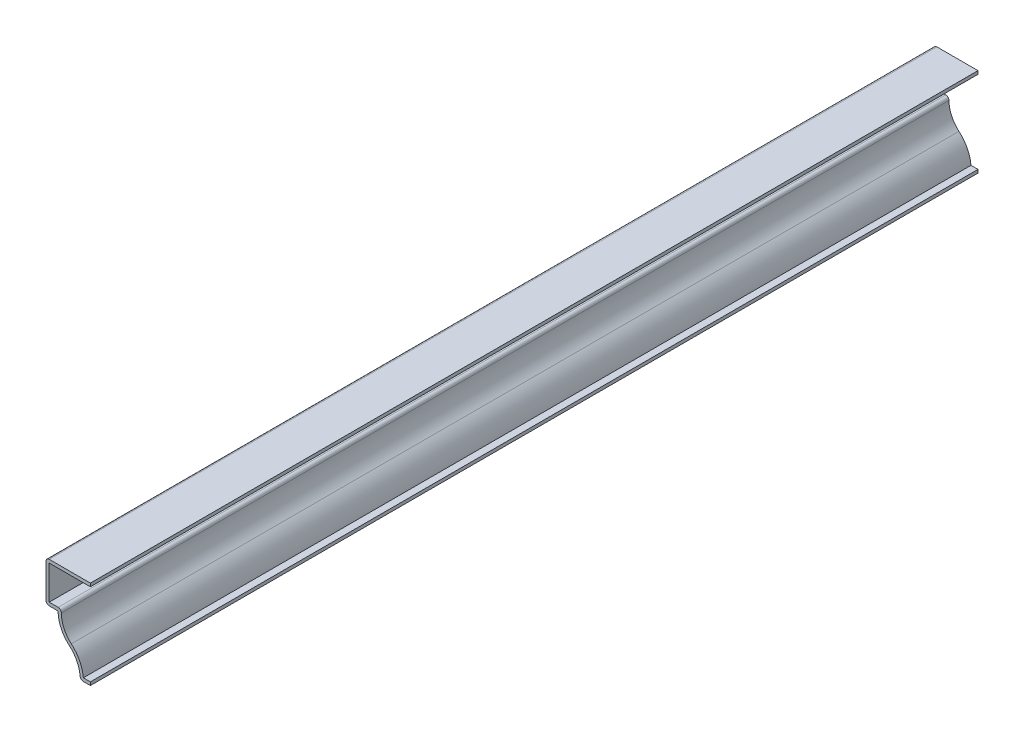
ISO-10303-21;
HEADER;
FILE_DESCRIPTION(('STEP AP214'),'2;1');
FILE_NAME('part.step','',(''),(''),'','','');
FILE_SCHEMA(('AUTOMOTIVE_DESIGN { 1 0 10303 214 1 1 1 1 }'));
ENDSEC;
DATA;
#1=APPLICATION_CONTEXT('core data for automotive mechanical design processes');
#2=APPLICATION_PROTOCOL_DEFINITION('international standard','automotive_design',2000,#1);
#3=PRODUCT_CONTEXT('',#1,'mechanical');
#4=PRODUCT('Part','Part','',(#3));
#5=PRODUCT_RELATED_PRODUCT_CATEGORY('part','',(#4));
#6=PRODUCT_DEFINITION_FORMATION('','',#4);
#7=PRODUCT_DEFINITION_CONTEXT('part definition',#1,'design');
#8=PRODUCT_DEFINITION('design','',#6,#7);
#9=PRODUCT_DEFINITION_SHAPE('','',#8);
#10=(LENGTH_UNIT() NAMED_UNIT(*) SI_UNIT(.MILLI.,.METRE.));
#11=(NAMED_UNIT(*) PLANE_ANGLE_UNIT() SI_UNIT($,.RADIAN.));
#12=(NAMED_UNIT(*) SI_UNIT($,.STERADIAN.) SOLID_ANGLE_UNIT());
#13=UNCERTAINTY_MEASURE_WITH_UNIT(LENGTH_MEASURE(1.E-05),#10,'distance_accuracy_value','');
#14=(GEOMETRIC_REPRESENTATION_CONTEXT(3) GLOBAL_UNCERTAINTY_ASSIGNED_CONTEXT((#13)) GLOBAL_UNIT_ASSIGNED_CONTEXT((#10,
#11,#12)) REPRESENTATION_CONTEXT('',''));
#15=CARTESIAN_POINT('',(0.,0.,0.));
#16=DIRECTION('',(0.,0.,1.));
#17=DIRECTION('',(1.,0.,0.));
#18=AXIS2_PLACEMENT_3D('',#15,#16,#17);
#19=CARTESIAN_POINT('',(0.,0.,-349.25));
#20=DIRECTION('',(0.,-1.,0.));
#21=DIRECTION('',(0.,0.,-1.));
#22=AXIS2_PLACEMENT_3D('',#19,#20,#21);
#23=PLANE('',#22);
#24=DIRECTION('',(1.,0.,0.));
#25=VECTOR('',#24,1.);
#26=CARTESIAN_POINT('',(0.,0.,0.));
#27=LINE('',#26,#25);
#28=CARTESIAN_POINT('',(-2.75712692758629,0.,0.));
#29=VERTEX_POINT('',#28);
#30=CARTESIAN_POINT('',(0.,0.,0.));
#31=VERTEX_POINT('',#30);
#32=EDGE_CURVE('E294',#29,#31,#27,.T.);
#33=ORIENTED_EDGE('',*,*,#32,.F.);
#34=DIRECTION('',(0.,0.,1.));
#35=VECTOR('',#34,1.);
#36=CARTESIAN_POINT('',(-2.75712692758629,0.,-349.25));
#37=LINE('',#36,#35);
#38=CARTESIAN_POINT('',(-2.75712692758629,0.,-349.25));
#39=VERTEX_POINT('',#38);
#40=EDGE_CURVE('E169',#29,#39,#37,.F.);
#41=ORIENTED_EDGE('',*,*,#40,.T.);
#42=DIRECTION('',(1.,0.,0.));
#43=VECTOR('',#42,1.);
#44=CARTESIAN_POINT('',(0.,0.,-349.25));
#45=LINE('',#44,#43);
#46=CARTESIAN_POINT('',(0.,0.,-349.25));
#47=VERTEX_POINT('',#46);
#48=EDGE_CURVE('E162',#39,#47,#45,.T.);
#49=ORIENTED_EDGE('',*,*,#48,.T.);
#50=DIRECTION('',(0.,0.,1.));
#51=VECTOR('',#50,1.);
#52=CARTESIAN_POINT('',(0.,0.,-349.25));
#53=LINE('',#52,#51);
#54=EDGE_CURVE('E166',#47,#31,#53,.T.);
#55=ORIENTED_EDGE('',*,*,#54,.T.);
#56=EDGE_LOOP('',(#33,#41,#49,#55));
#57=FACE_BOUND('',#56,.T.);
#58=ADVANCED_FACE('F35',(#57),#23,.T.);
#59=CARTESIAN_POINT('',(-16.5424715909091,0.,-349.25));
#60=DIRECTION('',(0.,0.,1.));
#61=DIRECTION('',(1.,0.,0.));
#62=AXIS2_PLACEMENT_3D('',#59,#60,#61);
#63=CYLINDRICAL_SURFACE('',#62,12.5737215909091);
#64=CARTESIAN_POINT('',(-16.5424715909091,0.,-349.25));
#65=DIRECTION('',(0.,0.,-1.));
#66=DIRECTION('',(-1.,0.,0.));
#67=AXIS2_PLACEMENT_3D('',#64,#65,#66);
#68=CIRCLE('',#67,12.5737215909091);
#69=CARTESIAN_POINT('',(-8.334375,9.525,-349.25));
#70=VERTEX_POINT('',#69);
#71=CARTESIAN_POINT('',(-4.02177152531619,1.15349231170185,-349.25));
#72=VERTEX_POINT('',#71);
#73=EDGE_CURVE('E186',#70,#72,#68,.T.);
#74=ORIENTED_EDGE('',*,*,#73,.T.);
#75=DIRECTION('',(0.,0.,1.));
#76=VECTOR('',#75,1.);
#77=CARTESIAN_POINT('',(-4.02177152531619,1.15349231170185,-349.25));
#78=LINE('',#77,#76);
#79=CARTESIAN_POINT('',(-4.02177152531619,1.15349231170185,0.));
#80=VERTEX_POINT('',#79);
#81=EDGE_CURVE('E195',#72,#80,#78,.T.);
#82=ORIENTED_EDGE('',*,*,#81,.T.);
#83=CARTESIAN_POINT('',(-16.5424715909091,0.,0.));
#84=DIRECTION('',(0.,0.,-1.));
#85=DIRECTION('',(-1.,0.,0.));
#86=AXIS2_PLACEMENT_3D('',#83,#84,#85);
#87=CIRCLE('',#86,12.5737215909091);
#88=CARTESIAN_POINT('',(-8.334375,9.525,0.));
#89=VERTEX_POINT('',#88);
#90=EDGE_CURVE('E172',#89,#80,#87,.T.);
#91=ORIENTED_EDGE('',*,*,#90,.F.);
#92=DIRECTION('',(0.,0.,1.));
#93=VECTOR('',#92,1.);
#94=CARTESIAN_POINT('',(-8.334375,9.525,-349.25));
#95=LINE('',#94,#93);
#96=EDGE_CURVE('E199',#70,#89,#95,.T.);
#97=ORIENTED_EDGE('',*,*,#96,.F.);
#98=EDGE_LOOP('',(#74,#82,#91,#97));
#99=FACE_BOUND('',#98,.T.);
#100=ADVANCED_FACE('F343',(#99),#63,.F.);
#101=CARTESIAN_POINT('',(-0.126278409090908,19.05,-349.25));
#102=DIRECTION('',(0.,0.,1.));
#103=DIRECTION('',(1.,0.,0.));
#104=AXIS2_PLACEMENT_3D('',#101,#102,#103);
#105=CYLINDRICAL_SURFACE('',#104,12.5737215909091);
#106=CARTESIAN_POINT('',(-0.126278409090908,19.05,0.));
#107=DIRECTION('',(0.,0.,1.));
#108=DIRECTION('',(1.,0.,0.));
#109=AXIS2_PLACEMENT_3D('',#106,#107,#108);
#110=CIRCLE('',#109,12.5737215909091);
#111=CARTESIAN_POINT('',(-12.7,19.05,0.));
#112=VERTEX_POINT('',#111);
#113=EDGE_CURVE('E255',#112,#89,#110,.T.);
#114=ORIENTED_EDGE('',*,*,#113,.F.);
#115=DIRECTION('',(0.,0.,1.));
#116=VECTOR('',#115,1.);
#117=CARTESIAN_POINT('',(-12.7,19.05,-349.25));
#118=LINE('',#117,#116);
#119=CARTESIAN_POINT('',(-12.7,19.05,-349.25));
#120=VERTEX_POINT('',#119);
#121=EDGE_CURVE('E265',#120,#112,#118,.T.);
#122=ORIENTED_EDGE('',*,*,#121,.F.);
#123=CARTESIAN_POINT('',(-0.126278409090908,19.05,-349.25));
#124=DIRECTION('',(0.,0.,1.));
#125=DIRECTION('',(1.,0.,0.));
#126=AXIS2_PLACEMENT_3D('',#123,#124,#125);
#127=CIRCLE('',#126,12.5737215909091);
#128=EDGE_CURVE('E191',#120,#70,#127,.T.);
#129=ORIENTED_EDGE('',*,*,#128,.T.);
#130=ORIENTED_EDGE('',*,*,#96,.T.);
#131=EDGE_LOOP('',(#114,#122,#129,#130));
#132=FACE_BOUND('',#131,.T.);
#133=ADVANCED_FACE('F347',(#132),#105,.T.);
#134=CARTESIAN_POINT('',(-17.4625,19.05,-349.25));
#135=DIRECTION('',(0.,-1.,0.));
#136=DIRECTION('',(1.,0.,0.));
#137=AXIS2_PLACEMENT_3D('',#134,#135,#136);
#138=PLANE('',#137);
#139=DIRECTION('',(1.,0.,0.));
#140=VECTOR('',#139,1.);
#141=CARTESIAN_POINT('',(-17.4625,19.05,0.));
#142=LINE('',#141,#140);
#143=CARTESIAN_POINT('',(-16.1925,19.05,0.));
#144=VERTEX_POINT('',#143);
#145=EDGE_CURVE('E231',#144,#112,#142,.T.);
#146=ORIENTED_EDGE('',*,*,#145,.F.);
#147=DIRECTION('',(0.,0.,1.));
#148=VECTOR('',#147,1.);
#149=CARTESIAN_POINT('',(-16.1925,19.05,-349.25));
#150=LINE('',#149,#148);
#151=CARTESIAN_POINT('',(-16.1925,19.05,-349.25));
#152=VERTEX_POINT('',#151);
#153=EDGE_CURVE('E43',#144,#152,#150,.F.);
#154=ORIENTED_EDGE('',*,*,#153,.T.);
#155=DIRECTION('',(1.,0.,0.));
#156=VECTOR('',#155,1.);
#157=CARTESIAN_POINT('',(-17.4625,19.05,-349.25));
#158=LINE('',#157,#156);
#159=EDGE_CURVE('E229',#152,#120,#158,.T.);
#160=ORIENTED_EDGE('',*,*,#159,.T.);
#161=ORIENTED_EDGE('',*,*,#121,.T.);
#162=EDGE_LOOP('',(#146,#154,#160,#161));
#163=FACE_BOUND('',#162,.T.);
#164=ADVANCED_FACE('F227',(#163),#138,.T.);
#165=CARTESIAN_POINT('',(-17.4625,34.925,-349.25));
#166=DIRECTION('',(-1.,0.,0.));
#167=DIRECTION('',(0.,-1.,0.));
#168=AXIS2_PLACEMENT_3D('',#165,#166,#167);
#169=PLANE('',#168);
#170=DIRECTION('',(0.,-1.,0.));
#171=VECTOR('',#170,1.);
#172=CARTESIAN_POINT('',(-17.4625,34.925,-349.25));
#173=LINE('',#172,#171);
#174=CARTESIAN_POINT('',(-17.4625,33.655,-349.25));
#175=VERTEX_POINT('',#174);
#176=CARTESIAN_POINT('',(-17.4625,20.32,-349.25));
#177=VERTEX_POINT('',#176);
#178=EDGE_CURVE('E239',#175,#177,#173,.T.);
#179=ORIENTED_EDGE('',*,*,#178,.T.);
#180=DIRECTION('',(0.,0.,1.));
#181=VECTOR('',#180,1.);
#182=CARTESIAN_POINT('',(-17.4625,20.32,-349.25));
#183=LINE('',#182,#181);
#184=CARTESIAN_POINT('',(-17.4625,20.32,0.));
#185=VERTEX_POINT('',#184);
#186=EDGE_CURVE('E221',#177,#185,#183,.T.);
#187=ORIENTED_EDGE('',*,*,#186,.T.);
#188=DIRECTION('',(0.,-1.,0.));
#189=VECTOR('',#188,1.);
#190=CARTESIAN_POINT('',(-17.4625,34.925,0.));
#191=LINE('',#190,#189);
#192=CARTESIAN_POINT('',(-17.4625,33.655,0.));
#193=VERTEX_POINT('',#192);
#194=EDGE_CURVE('E247',#193,#185,#191,.T.);
#195=ORIENTED_EDGE('',*,*,#194,.F.);
#196=DIRECTION('',(0.,0.,1.));
#197=VECTOR('',#196,1.);
#198=CARTESIAN_POINT('',(-17.4625,33.655,-349.25));
#199=LINE('',#198,#197);
#200=EDGE_CURVE('E219',#193,#175,#199,.F.);
#201=ORIENTED_EDGE('',*,*,#200,.T.);
#202=EDGE_LOOP('',(#179,#187,#195,#201));
#203=FACE_BOUND('',#202,.T.);
#204=ADVANCED_FACE('F246',(#203),#169,.T.);
#205=CARTESIAN_POINT('',(0.,34.925,-349.25));
#206=DIRECTION('',(0.,1.,0.));
#207=DIRECTION('',(0.,0.,1.));
#208=AXIS2_PLACEMENT_3D('',#205,#206,#207);
#209=PLANE('',#208);
#210=DIRECTION('',(-1.,0.,0.));
#211=VECTOR('',#210,1.);
#212=CARTESIAN_POINT('',(0.,34.925,-349.25));
#213=LINE('',#212,#211);
#214=CARTESIAN_POINT('',(0.,34.925,-349.25));
#215=VERTEX_POINT('',#214);
#216=CARTESIAN_POINT('',(-16.1925,34.925,-349.25));
#217=VERTEX_POINT('',#216);
#218=EDGE_CURVE('E335',#215,#217,#213,.T.);
#219=ORIENTED_EDGE('',*,*,#218,.T.);
#220=DIRECTION('',(0.,0.,1.));
#221=VECTOR('',#220,1.);
#222=CARTESIAN_POINT('',(-16.1925,34.925,-349.25));
#223=LINE('',#222,#221);
#224=CARTESIAN_POINT('',(-16.1925,34.925,0.));
#225=VERTEX_POINT('',#224);
#226=EDGE_CURVE('E11',#217,#225,#223,.T.);
#227=ORIENTED_EDGE('',*,*,#226,.T.);
#228=DIRECTION('',(-1.,0.,0.));
#229=VECTOR('',#228,1.);
#230=CARTESIAN_POINT('',(0.,34.925,0.));
#231=LINE('',#230,#229);
#232=CARTESIAN_POINT('',(0.,34.925,0.));
#233=VERTEX_POINT('',#232);
#234=EDGE_CURVE('E253',#233,#225,#231,.T.);
#235=ORIENTED_EDGE('',*,*,#234,.F.);
#236=DIRECTION('',(0.,0.,1.));
#237=VECTOR('',#236,1.);
#238=CARTESIAN_POINT('',(0.,34.925,-349.25));
#239=LINE('',#238,#237);
#240=EDGE_CURVE('E267',#215,#233,#239,.T.);
#241=ORIENTED_EDGE('',*,*,#240,.F.);
#242=EDGE_LOOP('',(#219,#227,#235,#241));
#243=FACE_BOUND('',#242,.T.);
#244=ADVANCED_FACE('F379',(#243),#209,.T.);
#245=CARTESIAN_POINT('',(0.,34.925,-349.25));
#246=DIRECTION('',(-1.,0.,0.));
#247=DIRECTION('',(0.,0.,1.));
#248=AXIS2_PLACEMENT_3D('',#245,#246,#247);
#249=PLANE('',#248);
#250=DIRECTION('',(0.,-1.,0.));
#251=VECTOR('',#250,1.);
#252=CARTESIAN_POINT('',(0.,34.925,0.));
#253=LINE('',#252,#251);
#254=CARTESIAN_POINT('',(0.,33.655,0.));
#255=VERTEX_POINT('',#254);
#256=EDGE_CURVE('E257',#233,#255,#253,.T.);
#257=ORIENTED_EDGE('',*,*,#256,.T.);
#258=DIRECTION('',(0.,0.,1.));
#259=VECTOR('',#258,1.);
#260=CARTESIAN_POINT('',(0.,33.655,-349.25));
#261=LINE('',#260,#259);
#262=CARTESIAN_POINT('',(0.,33.655,-349.25));
#263=VERTEX_POINT('',#262);
#264=EDGE_CURVE('E269',#263,#255,#261,.T.);
#265=ORIENTED_EDGE('',*,*,#264,.F.);
#266=DIRECTION('',(0.,-1.,0.));
#267=VECTOR('',#266,1.);
#268=CARTESIAN_POINT('',(0.,34.925,-349.25));
#269=LINE('',#268,#267);
#270=EDGE_CURVE('E333',#215,#263,#269,.T.);
#271=ORIENTED_EDGE('',*,*,#270,.F.);
#272=ORIENTED_EDGE('',*,*,#240,.T.);
#273=EDGE_LOOP('',(#257,#265,#271,#272));
#274=FACE_BOUND('',#273,.T.);
#275=ADVANCED_FACE('F307',(#274),#249,.F.);
#276=CARTESIAN_POINT('',(0.,33.655,-349.25));
#277=DIRECTION('',(0.,1.,0.));
#278=DIRECTION('',(0.,0.,1.));
#279=AXIS2_PLACEMENT_3D('',#276,#277,#278);
#280=PLANE('',#279);
#281=DIRECTION('',(1.,0.,0.));
#282=VECTOR('',#281,1.);
#283=CARTESIAN_POINT('',(0.,33.655,0.));
#284=LINE('',#283,#282);
#285=CARTESIAN_POINT('',(-16.1925,33.655,0.));
#286=VERTEX_POINT('',#285);
#287=EDGE_CURVE('E303',#255,#286,#284,.F.);
#288=ORIENTED_EDGE('',*,*,#287,.T.);
#289=DIRECTION('',(0.,0.,1.));
#290=VECTOR('',#289,1.);
#291=CARTESIAN_POINT('',(-16.1925,33.655,-349.25));
#292=LINE('',#291,#290);
#293=CARTESIAN_POINT('',(-16.1925,33.655,-349.25));
#294=VERTEX_POINT('',#293);
#295=EDGE_CURVE('E272',#294,#286,#292,.T.);
#296=ORIENTED_EDGE('',*,*,#295,.F.);
#297=DIRECTION('',(1.,0.,0.));
#298=VECTOR('',#297,1.);
#299=CARTESIAN_POINT('',(0.,33.655,-349.25));
#300=LINE('',#299,#298);
#301=EDGE_CURVE('E315',#263,#294,#300,.F.);
#302=ORIENTED_EDGE('',*,*,#301,.F.);
#303=ORIENTED_EDGE('',*,*,#264,.T.);
#304=EDGE_LOOP('',(#288,#296,#302,#303));
#305=FACE_BOUND('',#304,.T.);
#306=ADVANCED_FACE('F313',(#305),#280,.F.);
#307=CARTESIAN_POINT('',(-16.1925,34.925,-349.25));
#308=DIRECTION('',(-1.,0.,0.));
#309=DIRECTION('',(0.,-1.,0.));
#310=AXIS2_PLACEMENT_3D('',#307,#308,#309);
#311=PLANE('',#310);
#312=DIRECTION('',(0.,-1.,0.));
#313=VECTOR('',#312,1.);
#314=CARTESIAN_POINT('',(-16.1925,34.925,0.));
#315=LINE('',#314,#313);
#316=CARTESIAN_POINT('',(-16.1925,20.32,0.));
#317=VERTEX_POINT('',#316);
#318=EDGE_CURVE('E301',#286,#317,#315,.T.);
#319=ORIENTED_EDGE('',*,*,#318,.T.);
#320=DIRECTION('',(0.,0.,1.));
#321=VECTOR('',#320,1.);
#322=CARTESIAN_POINT('',(-16.1925,20.32,-349.25));
#323=LINE('',#322,#321);
#324=CARTESIAN_POINT('',(-16.1925,20.32,-349.25));
#325=VERTEX_POINT('',#324);
#326=EDGE_CURVE('E275',#325,#317,#323,.T.);
#327=ORIENTED_EDGE('',*,*,#326,.F.);
#328=DIRECTION('',(0.,-1.,0.));
#329=VECTOR('',#328,1.);
#330=CARTESIAN_POINT('',(-16.1925,34.925,-349.25));
#331=LINE('',#330,#329);
#332=EDGE_CURVE('E324',#294,#325,#331,.T.);
#333=ORIENTED_EDGE('',*,*,#332,.F.);
#334=ORIENTED_EDGE('',*,*,#295,.T.);
#335=EDGE_LOOP('',(#319,#327,#333,#334));
#336=FACE_BOUND('',#335,.T.);
#337=ADVANCED_FACE('F320',(#336),#311,.F.);
#338=CARTESIAN_POINT('',(-17.4625,20.32,-349.25));
#339=DIRECTION('',(0.,-1.,0.));
#340=DIRECTION('',(1.,0.,0.));
#341=AXIS2_PLACEMENT_3D('',#338,#339,#340);
#342=PLANE('',#341);
#343=DIRECTION('',(1.,0.,0.));
#344=VECTOR('',#343,1.);
#345=CARTESIAN_POINT('',(-17.4625,20.32,0.));
#346=LINE('',#345,#344);
#347=CARTESIAN_POINT('',(-12.7,20.32,0.));
#348=VERTEX_POINT('',#347);
#349=EDGE_CURVE('E299',#317,#348,#346,.T.);
#350=ORIENTED_EDGE('',*,*,#349,.T.);
#351=DIRECTION('',(0.,0.,1.));
#352=VECTOR('',#351,1.);
#353=CARTESIAN_POINT('',(-12.7,20.32,-349.25));
#354=LINE('',#353,#352);
#355=CARTESIAN_POINT('',(-12.7,20.32,-349.25));
#356=VERTEX_POINT('',#355);
#357=EDGE_CURVE('E58',#348,#356,#354,.F.);
#358=ORIENTED_EDGE('',*,*,#357,.T.);
#359=DIRECTION('',(1.,0.,0.));
#360=VECTOR('',#359,1.);
#361=CARTESIAN_POINT('',(-17.4625,20.32,-349.25));
#362=LINE('',#361,#360);
#363=EDGE_CURVE('E323',#325,#356,#362,.T.);
#364=ORIENTED_EDGE('',*,*,#363,.F.);
#365=ORIENTED_EDGE('',*,*,#326,.T.);
#366=EDGE_LOOP('',(#350,#358,#364,#365));
#367=FACE_BOUND('',#366,.T.);
#368=ADVANCED_FACE('F322',(#367),#342,.F.);
#369=CARTESIAN_POINT('',(-0.126278409090908,19.05,-349.25));
#370=DIRECTION('',(0.,0.,1.));
#371=DIRECTION('',(1.,0.,0.));
#372=AXIS2_PLACEMENT_3D('',#369,#370,#371);
#373=CYLINDRICAL_SURFACE('',#372,11.3037215909091);
#374=CARTESIAN_POINT('',(-0.126278409090908,19.05,-349.25));
#375=DIRECTION('',(0.,0.,1.));
#376=DIRECTION('',(1.,0.,0.));
#377=AXIS2_PLACEMENT_3D('',#374,#375,#376);
#378=CIRCLE('',#377,11.3037215909091);
#379=CARTESIAN_POINT('',(-11.43,19.05,-349.25));
#380=VERTEX_POINT('',#379);
#381=CARTESIAN_POINT('',(-7.50532191535151,10.4870659971306,-349.25));
#382=VERTEX_POINT('',#381);
#383=EDGE_CURVE('E325',#380,#382,#378,.T.);
#384=ORIENTED_EDGE('',*,*,#383,.F.);
#385=DIRECTION('',(0.,0.,1.));
#386=VECTOR('',#385,1.);
#387=CARTESIAN_POINT('',(-11.43,19.05,-349.25));
#388=LINE('',#387,#386);
#389=CARTESIAN_POINT('',(-11.43,19.05,0.));
#390=VERTEX_POINT('',#389);
#391=EDGE_CURVE('E215',#380,#390,#388,.T.);
#392=ORIENTED_EDGE('',*,*,#391,.T.);
#393=CARTESIAN_POINT('',(-0.126278409090908,19.05,0.));
#394=DIRECTION('',(0.,0.,1.));
#395=DIRECTION('',(1.,0.,0.));
#396=AXIS2_PLACEMENT_3D('',#393,#394,#395);
#397=CIRCLE('',#396,11.3037215909091);
#398=CARTESIAN_POINT('',(-7.50532191535151,10.4870659971306,0.));
#399=VERTEX_POINT('',#398);
#400=EDGE_CURVE('E292',#390,#399,#397,.T.);
#401=ORIENTED_EDGE('',*,*,#400,.T.);
#402=DIRECTION('',(0.,0.,1.));
#403=VECTOR('',#402,1.);
#404=CARTESIAN_POINT('',(-7.50532191535151,10.4870659971306,-349.25));
#405=LINE('',#404,#403);
#406=EDGE_CURVE('E278',#382,#399,#405,.T.);
#407=ORIENTED_EDGE('',*,*,#406,.F.);
#408=EDGE_LOOP('',(#384,#392,#401,#407));
#409=FACE_BOUND('',#408,.T.);
#410=ADVANCED_FACE('F395',(#409),#373,.F.);
#411=CARTESIAN_POINT('',(-16.5424715909091,0.,-349.25));
#412=DIRECTION('',(0.,0.,1.));
#413=DIRECTION('',(1.,0.,0.));
#414=AXIS2_PLACEMENT_3D('',#411,#412,#413);
#415=CYLINDRICAL_SURFACE('',#414,13.8437215909091);
#416=CARTESIAN_POINT('',(-16.5424715909091,0.,0.));
#417=DIRECTION('',(0.,0.,1.));
#418=DIRECTION('',(1.,0.,0.));
#419=AXIS2_PLACEMENT_3D('',#416,#417,#418);
#420=CIRCLE('',#419,13.8437215909091);
#421=CARTESIAN_POINT('',(-2.75712692758629,1.27,0.));
#422=VERTEX_POINT('',#421);
#423=EDGE_CURVE('E290',#399,#422,#420,.F.);
#424=ORIENTED_EDGE('',*,*,#423,.T.);
#425=DIRECTION('',(0.,0.,1.));
#426=VECTOR('',#425,1.);
#427=CARTESIAN_POINT('',(-2.75712692758629,1.27,-349.25));
#428=LINE('',#427,#426);
#429=CARTESIAN_POINT('',(-2.75712692758629,1.27,-349.25));
#430=VERTEX_POINT('',#429);
#431=EDGE_CURVE('E188',#430,#422,#428,.T.);
#432=ORIENTED_EDGE('',*,*,#431,.F.);
#433=CARTESIAN_POINT('',(-16.5424715909091,0.,-349.25));
#434=DIRECTION('',(0.,0.,1.));
#435=DIRECTION('',(1.,0.,0.));
#436=AXIS2_PLACEMENT_3D('',#433,#434,#435);
#437=CIRCLE('',#436,13.8437215909091);
#438=EDGE_CURVE('E328',#382,#430,#437,.F.);
#439=ORIENTED_EDGE('',*,*,#438,.F.);
#440=ORIENTED_EDGE('',*,*,#406,.T.);
#441=EDGE_LOOP('',(#424,#432,#439,#440));
#442=FACE_BOUND('',#441,.T.);
#443=ADVANCED_FACE('F398',(#442),#415,.T.);
#444=CARTESIAN_POINT('',(0.,1.27,-349.25));
#445=DIRECTION('',(0.,-1.,0.));
#446=DIRECTION('',(0.,0.,-1.));
#447=AXIS2_PLACEMENT_3D('',#444,#445,#446);
#448=PLANE('',#447);
#449=DIRECTION('',(1.,0.,0.));
#450=VECTOR('',#449,1.);
#451=CARTESIAN_POINT('',(0.,1.27,0.));
#452=LINE('',#451,#450);
#453=CARTESIAN_POINT('',(0.,1.27,0.));
#454=VERTEX_POINT('',#453);
#455=EDGE_CURVE('E285',#422,#454,#452,.T.);
#456=ORIENTED_EDGE('',*,*,#455,.T.);
#457=DIRECTION('',(0.,0.,1.));
#458=VECTOR('',#457,1.);
#459=CARTESIAN_POINT('',(0.,1.27,-349.25));
#460=LINE('',#459,#458);
#461=CARTESIAN_POINT('',(0.,1.27,-349.25));
#462=VERTEX_POINT('',#461);
#463=EDGE_CURVE('E185',#462,#454,#460,.T.);
#464=ORIENTED_EDGE('',*,*,#463,.F.);
#465=DIRECTION('',(1.,0.,0.));
#466=VECTOR('',#465,1.);
#467=CARTESIAN_POINT('',(0.,1.27,-349.25));
#468=LINE('',#467,#466);
#469=EDGE_CURVE('E177',#430,#462,#468,.T.);
#470=ORIENTED_EDGE('',*,*,#469,.F.);
#471=ORIENTED_EDGE('',*,*,#431,.T.);
#472=EDGE_LOOP('',(#456,#464,#470,#471));
#473=FACE_BOUND('',#472,.T.);
#474=ADVANCED_FACE('F284',(#473),#448,.F.);
#475=CARTESIAN_POINT('',(0.,1.27,-349.25));
#476=DIRECTION('',(-1.,0.,0.));
#477=DIRECTION('',(0.,0.,1.));
#478=AXIS2_PLACEMENT_3D('',#475,#476,#477);
#479=PLANE('',#478);
#480=DIRECTION('',(0.,-1.,0.));
#481=VECTOR('',#480,1.);
#482=CARTESIAN_POINT('',(0.,1.27,0.));
#483=LINE('',#482,#481);
#484=EDGE_CURVE('E184',#454,#31,#483,.T.);
#485=ORIENTED_EDGE('',*,*,#484,.T.);
#486=ORIENTED_EDGE('',*,*,#54,.F.);
#487=DIRECTION('',(0.,-1.,0.));
#488=VECTOR('',#487,1.);
#489=CARTESIAN_POINT('',(0.,1.27,-349.25));
#490=LINE('',#489,#488);
#491=EDGE_CURVE('E171',#462,#47,#490,.T.);
#492=ORIENTED_EDGE('',*,*,#491,.F.);
#493=ORIENTED_EDGE('',*,*,#463,.T.);
#494=EDGE_LOOP('',(#485,#486,#492,#493));
#495=FACE_BOUND('',#494,.T.);
#496=ADVANCED_FACE('F182',(#495),#479,.F.);
#497=CARTESIAN_POINT('',(-16.5424715909091,0.,-349.25));
#498=DIRECTION('',(0.,0.,1.));
#499=DIRECTION('',(1.,0.,0.));
#500=AXIS2_PLACEMENT_3D('',#497,#498,#499);
#501=PLANE('',#500);
#502=ORIENTED_EDGE('',*,*,#48,.F.);
#503=CARTESIAN_POINT('',(-2.75712692758629,1.27,-349.25));
#504=DIRECTION('',(0.,0.,1.));
#505=DIRECTION('',(1.,0.,0.));
#506=AXIS2_PLACEMENT_3D('',#503,#504,#505);
#507=CIRCLE('',#506,1.27);
#508=EDGE_CURVE('E213',#39,#72,#507,.F.);
#509=ORIENTED_EDGE('',*,*,#508,.T.);
#510=ORIENTED_EDGE('',*,*,#73,.F.);
#511=ORIENTED_EDGE('',*,*,#128,.F.);
#512=ORIENTED_EDGE('',*,*,#159,.F.);
#513=CARTESIAN_POINT('',(-16.1925,20.32,-349.25));
#514=DIRECTION('',(0.,0.,1.));
#515=DIRECTION('',(1.,0.,0.));
#516=AXIS2_PLACEMENT_3D('',#513,#514,#515);
#517=CIRCLE('',#516,1.27);
#518=EDGE_CURVE('E210',#152,#177,#517,.F.);
#519=ORIENTED_EDGE('',*,*,#518,.T.);
#520=ORIENTED_EDGE('',*,*,#178,.F.);
#521=CARTESIAN_POINT('',(-16.1925,33.655,-349.25));
#522=DIRECTION('',(0.,0.,1.));
#523=DIRECTION('',(1.,0.,0.));
#524=AXIS2_PLACEMENT_3D('',#521,#522,#523);
#525=CIRCLE('',#524,1.27);
#526=EDGE_CURVE('E208',#175,#217,#525,.F.);
#527=ORIENTED_EDGE('',*,*,#526,.T.);
#528=ORIENTED_EDGE('',*,*,#218,.F.);
#529=ORIENTED_EDGE('',*,*,#270,.T.);
#530=ORIENTED_EDGE('',*,*,#301,.T.);
#531=ORIENTED_EDGE('',*,*,#332,.T.);
#532=ORIENTED_EDGE('',*,*,#363,.T.);
#533=CARTESIAN_POINT('',(-12.7,19.05,-349.25));
#534=DIRECTION('',(0.,0.,1.));
#535=DIRECTION('',(1.,0.,0.));
#536=AXIS2_PLACEMENT_3D('',#533,#534,#535);
#537=CIRCLE('',#536,1.27);
#538=EDGE_CURVE('E50',#356,#380,#537,.F.);
#539=ORIENTED_EDGE('',*,*,#538,.T.);
#540=ORIENTED_EDGE('',*,*,#383,.T.);
#541=ORIENTED_EDGE('',*,*,#438,.T.);
#542=ORIENTED_EDGE('',*,*,#469,.T.);
#543=ORIENTED_EDGE('',*,*,#491,.T.);
#544=EDGE_LOOP('',(#502,#509,#510,#511,#512,#519,#520,#527,#528,#529,#530,#531,#532,#539,#540,
#541,#542,#543));
#545=FACE_BOUND('',#544,.T.);
#546=ADVANCED_FACE('F175',(#545),#501,.F.);
#547=CARTESIAN_POINT('',(-16.5424715909091,0.,0.));
#548=DIRECTION('',(0.,0.,1.));
#549=DIRECTION('',(1.,0.,0.));
#550=AXIS2_PLACEMENT_3D('',#547,#548,#549);
#551=PLANE('',#550);
#552=ORIENTED_EDGE('',*,*,#90,.T.);
#553=CARTESIAN_POINT('',(-2.75712692758629,1.27,0.));
#554=DIRECTION('',(0.,0.,1.));
#555=DIRECTION('',(1.,0.,0.));
#556=AXIS2_PLACEMENT_3D('',#553,#554,#555);
#557=CIRCLE('',#556,1.27);
#558=EDGE_CURVE('E205',#80,#29,#557,.T.);
#559=ORIENTED_EDGE('',*,*,#558,.T.);
#560=ORIENTED_EDGE('',*,*,#32,.T.);
#561=ORIENTED_EDGE('',*,*,#484,.F.);
#562=ORIENTED_EDGE('',*,*,#455,.F.);
#563=ORIENTED_EDGE('',*,*,#423,.F.);
#564=ORIENTED_EDGE('',*,*,#400,.F.);
#565=CARTESIAN_POINT('',(-12.7,19.05,0.));
#566=DIRECTION('',(0.,0.,1.));
#567=DIRECTION('',(1.,0.,0.));
#568=AXIS2_PLACEMENT_3D('',#565,#566,#567);
#569=CIRCLE('',#568,1.27);
#570=EDGE_CURVE('E203',#390,#348,#569,.T.);
#571=ORIENTED_EDGE('',*,*,#570,.T.);
#572=ORIENTED_EDGE('',*,*,#349,.F.);
#573=ORIENTED_EDGE('',*,*,#318,.F.);
#574=ORIENTED_EDGE('',*,*,#287,.F.);
#575=ORIENTED_EDGE('',*,*,#256,.F.);
#576=ORIENTED_EDGE('',*,*,#234,.T.);
#577=CARTESIAN_POINT('',(-16.1925,33.655,0.));
#578=DIRECTION('',(0.,0.,1.));
#579=DIRECTION('',(1.,0.,0.));
#580=AXIS2_PLACEMENT_3D('',#577,#578,#579);
#581=CIRCLE('',#580,1.27);
#582=EDGE_CURVE('E198',#225,#193,#581,.T.);
#583=ORIENTED_EDGE('',*,*,#582,.T.);
#584=ORIENTED_EDGE('',*,*,#194,.T.);
#585=CARTESIAN_POINT('',(-16.1925,20.32,0.));
#586=DIRECTION('',(0.,0.,1.));
#587=DIRECTION('',(1.,0.,0.));
#588=AXIS2_PLACEMENT_3D('',#585,#586,#587);
#589=CIRCLE('',#588,1.27);
#590=EDGE_CURVE('E201',#185,#144,#589,.T.);
#591=ORIENTED_EDGE('',*,*,#590,.T.);
#592=ORIENTED_EDGE('',*,*,#145,.T.);
#593=ORIENTED_EDGE('',*,*,#113,.T.);
#594=EDGE_LOOP('',(#552,#559,#560,#561,#562,#563,#564,#571,#572,#573,#574,#575,#576,#583,#584,
#591,#592,#593));
#595=FACE_BOUND('',#594,.T.);
#596=ADVANCED_FACE('F251',(#595),#551,.T.);
#597=CARTESIAN_POINT('',(-2.75712692758629,1.27,-349.25));
#598=DIRECTION('',(0.,0.,1.));
#599=DIRECTION('',(1.,0.,0.));
#600=AXIS2_PLACEMENT_3D('',#597,#598,#599);
#601=CYLINDRICAL_SURFACE('',#600,1.27);
#602=ORIENTED_EDGE('',*,*,#508,.F.);
#603=ORIENTED_EDGE('',*,*,#40,.F.);
#604=ORIENTED_EDGE('',*,*,#558,.F.);
#605=ORIENTED_EDGE('',*,*,#81,.F.);
#606=EDGE_LOOP('',(#602,#603,#604,#605));
#607=FACE_BOUND('',#606,.T.);
#608=ADVANCED_FACE('F340',(#607),#601,.T.);
#609=CARTESIAN_POINT('',(-12.7,19.05,-349.25));
#610=DIRECTION('',(0.,0.,1.));
#611=DIRECTION('',(1.,0.,0.));
#612=AXIS2_PLACEMENT_3D('',#609,#610,#611);
#613=CYLINDRICAL_SURFACE('',#612,1.27);
#614=ORIENTED_EDGE('',*,*,#538,.F.);
#615=ORIENTED_EDGE('',*,*,#357,.F.);
#616=ORIENTED_EDGE('',*,*,#570,.F.);
#617=ORIENTED_EDGE('',*,*,#391,.F.);
#618=EDGE_LOOP('',(#614,#615,#616,#617));
#619=FACE_BOUND('',#618,.T.);
#620=ADVANCED_FACE('F365',(#619),#613,.T.);
#621=CARTESIAN_POINT('',(-16.1925,20.32,-349.25));
#622=DIRECTION('',(0.,0.,1.));
#623=DIRECTION('',(1.,0.,0.));
#624=AXIS2_PLACEMENT_3D('',#621,#622,#623);
#625=CYLINDRICAL_SURFACE('',#624,1.27);
#626=ORIENTED_EDGE('',*,*,#518,.F.);
#627=ORIENTED_EDGE('',*,*,#153,.F.);
#628=ORIENTED_EDGE('',*,*,#590,.F.);
#629=ORIENTED_EDGE('',*,*,#186,.F.);
#630=EDGE_LOOP('',(#626,#627,#628,#629));
#631=FACE_BOUND('',#630,.T.);
#632=ADVANCED_FACE('F242',(#631),#625,.T.);
#633=CARTESIAN_POINT('',(-16.1925,33.655,-349.25));
#634=DIRECTION('',(0.,0.,1.));
#635=DIRECTION('',(1.,0.,0.));
#636=AXIS2_PLACEMENT_3D('',#633,#634,#635);
#637=CYLINDRICAL_SURFACE('',#636,1.27);
#638=ORIENTED_EDGE('',*,*,#526,.F.);
#639=ORIENTED_EDGE('',*,*,#200,.F.);
#640=ORIENTED_EDGE('',*,*,#582,.F.);
#641=ORIENTED_EDGE('',*,*,#226,.F.);
#642=EDGE_LOOP('',(#638,#639,#640,#641));
#643=FACE_BOUND('',#642,.T.);
#644=ADVANCED_FACE('F37',(#643),#637,.T.);
#645=CLOSED_SHELL('',(#58,#100,#133,#164,#204,#244,#275,#306,#337,#368,#410,#443,#474,#496,#546,
#596,#608,#620,#632,#644));
#646=MANIFOLD_SOLID_BREP('B2',#645);
#647=ADVANCED_BREP_SHAPE_REPRESENTATION('',(#18,#646),#14);
#648=SHAPE_DEFINITION_REPRESENTATION(#9,#647);
ENDSEC;
END-ISO-10303-21;
